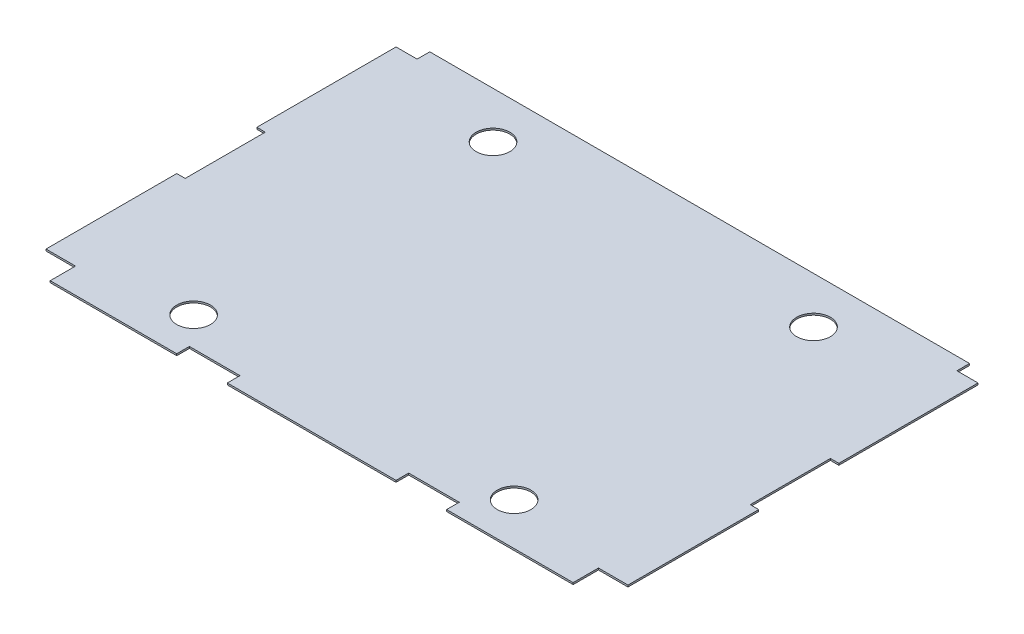
ISO-10303-21;
HEADER;
FILE_DESCRIPTION(('STEP AP214'),'2;1');
FILE_NAME('part.step','',(''),(''),'','','');
FILE_SCHEMA(('AUTOMOTIVE_DESIGN { 1 0 10303 214 1 1 1 1 }'));
ENDSEC;
DATA;
#1=APPLICATION_CONTEXT('core data for automotive mechanical design processes');
#2=APPLICATION_PROTOCOL_DEFINITION('international standard','automotive_design',2000,#1);
#3=PRODUCT_CONTEXT('',#1,'mechanical');
#4=PRODUCT('Part','Part','',(#3));
#5=PRODUCT_RELATED_PRODUCT_CATEGORY('part','',(#4));
#6=PRODUCT_DEFINITION_FORMATION('','',#4);
#7=PRODUCT_DEFINITION_CONTEXT('part definition',#1,'design');
#8=PRODUCT_DEFINITION('design','',#6,#7);
#9=PRODUCT_DEFINITION_SHAPE('','',#8);
#10=(LENGTH_UNIT() NAMED_UNIT(*) SI_UNIT(.MILLI.,.METRE.));
#11=(NAMED_UNIT(*) PLANE_ANGLE_UNIT() SI_UNIT($,.RADIAN.));
#12=(NAMED_UNIT(*) SI_UNIT($,.STERADIAN.) SOLID_ANGLE_UNIT());
#13=UNCERTAINTY_MEASURE_WITH_UNIT(LENGTH_MEASURE(1.E-05),#10,'distance_accuracy_value','');
#14=(GEOMETRIC_REPRESENTATION_CONTEXT(3) GLOBAL_UNCERTAINTY_ASSIGNED_CONTEXT((#13)) GLOBAL_UNIT_ASSIGNED_CONTEXT((#10,
#11,#12)) REPRESENTATION_CONTEXT('',''));
#15=CARTESIAN_POINT('',(0.,0.,0.));
#16=DIRECTION('',(0.,0.,1.));
#17=DIRECTION('',(1.,0.,0.));
#18=AXIS2_PLACEMENT_3D('',#15,#16,#17);
#19=CARTESIAN_POINT('',(0.,2.65684,0.));
#20=DIRECTION('',(0.,-1.,0.));
#21=DIRECTION('',(0.,0.,-1.));
#22=AXIS2_PLACEMENT_3D('',#19,#20,#21);
#23=PLANE('',#22);
#24=CARTESIAN_POINT('',(-241.3,2.65684,-222.25));
#25=DIRECTION('',(0.,1.,0.));
#26=DIRECTION('',(0.,0.,-1.));
#27=AXIS2_PLACEMENT_3D('',#24,#25,#26);
#28=CIRCLE('',#27,25.4);
#29=CARTESIAN_POINT('',(-241.3,2.65684,-247.65));
#30=VERTEX_POINT('',#29);
#31=EDGE_CURVE('E499',#30,#30,#28,.T.);
#32=ORIENTED_EDGE('',*,*,#31,.F.);
#33=EDGE_LOOP('',(#32));
#34=FACE_BOUND('',#33,.T.);
#35=CARTESIAN_POINT('',(241.3,2.65684,-222.25));
#36=DIRECTION('',(0.,1.,0.));
#37=DIRECTION('',(0.,0.,1.));
#38=AXIS2_PLACEMENT_3D('',#35,#36,#37);
#39=CIRCLE('',#38,25.4);
#40=CARTESIAN_POINT('',(241.3,2.65684,-196.85));
#41=VERTEX_POINT('',#40);
#42=EDGE_CURVE('E253',#41,#41,#39,.T.);
#43=ORIENTED_EDGE('',*,*,#42,.F.);
#44=EDGE_LOOP('',(#43));
#45=FACE_BOUND('',#44,.T.);
#46=DIRECTION('',(0.,0.,1.));
#47=VECTOR('',#46,1.);
#48=CARTESIAN_POINT('',(-438.15,2.65684,-63.5));
#49=LINE('',#48,#47);
#50=CARTESIAN_POINT('',(-438.15,2.65684,-273.05));
#51=VERTEX_POINT('',#50);
#52=CARTESIAN_POINT('',(-438.15,2.65684,-63.5));
#53=VERTEX_POINT('',#52);
#54=EDGE_CURVE('E304',#51,#53,#49,.T.);
#55=ORIENTED_EDGE('',*,*,#54,.T.);
#56=DIRECTION('',(1.,0.,0.));
#57=VECTOR('',#56,1.);
#58=CARTESIAN_POINT('',(-425.45,2.65684,-63.5));
#59=LINE('',#58,#57);
#60=CARTESIAN_POINT('',(-425.45,2.65684,-63.5));
#61=VERTEX_POINT('',#60);
#62=EDGE_CURVE('E152',#53,#61,#59,.T.);
#63=ORIENTED_EDGE('',*,*,#62,.T.);
#64=DIRECTION('',(0.,0.,1.));
#65=VECTOR('',#64,1.);
#66=CARTESIAN_POINT('',(-425.45,2.65684,57.15));
#67=LINE('',#66,#65);
#68=CARTESIAN_POINT('',(-425.45,2.65684,57.15));
#69=VERTEX_POINT('',#68);
#70=EDGE_CURVE('E379',#61,#69,#67,.T.);
#71=ORIENTED_EDGE('',*,*,#70,.T.);
#72=DIRECTION('',(-1.,0.,0.));
#73=VECTOR('',#72,1.);
#74=CARTESIAN_POINT('',(-438.15,2.65684,57.15));
#75=LINE('',#74,#73);
#76=CARTESIAN_POINT('',(-438.15,2.65684,57.15));
#77=VERTEX_POINT('',#76);
#78=EDGE_CURVE('E398',#69,#77,#75,.T.);
#79=ORIENTED_EDGE('',*,*,#78,.T.);
#80=DIRECTION('',(0.,0.,1.));
#81=VECTOR('',#80,1.);
#82=CARTESIAN_POINT('',(-438.15,2.65684,253.999999999999));
#83=LINE('',#82,#81);
#84=CARTESIAN_POINT('',(-438.15,2.65684,253.999999999999));
#85=VERTEX_POINT('',#84);
#86=EDGE_CURVE('E395',#77,#85,#83,.T.);
#87=ORIENTED_EDGE('',*,*,#86,.T.);
#88=DIRECTION('',(1.,0.,0.));
#89=VECTOR('',#88,1.);
#90=CARTESIAN_POINT('',(-393.7,2.65684,254.));
#91=LINE('',#90,#89);
#92=CARTESIAN_POINT('',(-393.7,2.65684,254.));
#93=VERTEX_POINT('',#92);
#94=EDGE_CURVE('E397',#85,#93,#91,.T.);
#95=ORIENTED_EDGE('',*,*,#94,.T.);
#96=DIRECTION('',(0.,0.,1.));
#97=VECTOR('',#96,1.);
#98=CARTESIAN_POINT('',(-393.7,2.65684,292.1));
#99=LINE('',#98,#97);
#100=CARTESIAN_POINT('',(-393.7,2.65684,292.1));
#101=VERTEX_POINT('',#100);
#102=EDGE_CURVE('E400',#93,#101,#99,.T.);
#103=ORIENTED_EDGE('',*,*,#102,.T.);
#104=DIRECTION('',(1.,0.,0.));
#105=VECTOR('',#104,1.);
#106=CARTESIAN_POINT('',(-203.2,2.65684,292.1));
#107=LINE('',#106,#105);
#108=CARTESIAN_POINT('',(-203.2,2.65684,292.1));
#109=VERTEX_POINT('',#108);
#110=EDGE_CURVE('E406',#101,#109,#107,.T.);
#111=ORIENTED_EDGE('',*,*,#110,.T.);
#112=DIRECTION('',(0.,0.,-1.));
#113=VECTOR('',#112,1.);
#114=CARTESIAN_POINT('',(-203.2,2.65684,273.05));
#115=LINE('',#114,#113);
#116=CARTESIAN_POINT('',(-203.2,2.65684,273.05));
#117=VERTEX_POINT('',#116);
#118=EDGE_CURVE('E408',#109,#117,#115,.T.);
#119=ORIENTED_EDGE('',*,*,#118,.T.);
#120=DIRECTION('',(1.,0.,0.));
#121=VECTOR('',#120,1.);
#122=CARTESIAN_POINT('',(-127.,2.65684,273.05));
#123=LINE('',#122,#121);
#124=CARTESIAN_POINT('',(-127.,2.65684,273.05));
#125=VERTEX_POINT('',#124);
#126=EDGE_CURVE('E410',#117,#125,#123,.T.);
#127=ORIENTED_EDGE('',*,*,#126,.T.);
#128=DIRECTION('',(0.,0.,1.));
#129=VECTOR('',#128,1.);
#130=CARTESIAN_POINT('',(-127.,2.65684,292.1));
#131=LINE('',#130,#129);
#132=CARTESIAN_POINT('',(-127.,2.65684,292.1));
#133=VERTEX_POINT('',#132);
#134=EDGE_CURVE('E412',#125,#133,#131,.T.);
#135=ORIENTED_EDGE('',*,*,#134,.T.);
#136=DIRECTION('',(1.,0.,0.));
#137=VECTOR('',#136,1.);
#138=CARTESIAN_POINT('',(127.,2.65684,292.1));
#139=LINE('',#138,#137);
#140=CARTESIAN_POINT('',(127.,2.65684,292.1));
#141=VERTEX_POINT('',#140);
#142=EDGE_CURVE('E414',#133,#141,#139,.T.);
#143=ORIENTED_EDGE('',*,*,#142,.T.);
#144=DIRECTION('',(0.,0.,-1.));
#145=VECTOR('',#144,1.);
#146=CARTESIAN_POINT('',(127.,2.65684,273.05));
#147=LINE('',#146,#145);
#148=CARTESIAN_POINT('',(127.,2.65684,273.05));
#149=VERTEX_POINT('',#148);
#150=EDGE_CURVE('E416',#141,#149,#147,.T.);
#151=ORIENTED_EDGE('',*,*,#150,.T.);
#152=DIRECTION('',(1.,0.,0.));
#153=VECTOR('',#152,1.);
#154=CARTESIAN_POINT('',(203.2,2.65684,273.05));
#155=LINE('',#154,#153);
#156=CARTESIAN_POINT('',(203.2,2.65684,273.05));
#157=VERTEX_POINT('',#156);
#158=EDGE_CURVE('E418',#149,#157,#155,.T.);
#159=ORIENTED_EDGE('',*,*,#158,.T.);
#160=DIRECTION('',(0.,0.,1.));
#161=VECTOR('',#160,1.);
#162=CARTESIAN_POINT('',(203.2,2.65684,292.1));
#163=LINE('',#162,#161);
#164=CARTESIAN_POINT('',(203.2,2.65684,292.1));
#165=VERTEX_POINT('',#164);
#166=EDGE_CURVE('E420',#157,#165,#163,.T.);
#167=ORIENTED_EDGE('',*,*,#166,.T.);
#168=DIRECTION('',(1.,0.,0.));
#169=VECTOR('',#168,1.);
#170=CARTESIAN_POINT('',(393.7,2.65684,292.1));
#171=LINE('',#170,#169);
#172=CARTESIAN_POINT('',(393.7,2.65684,292.1));
#173=VERTEX_POINT('',#172);
#174=EDGE_CURVE('E422',#165,#173,#171,.T.);
#175=ORIENTED_EDGE('',*,*,#174,.T.);
#176=DIRECTION('',(0.,0.,-1.));
#177=VECTOR('',#176,1.);
#178=CARTESIAN_POINT('',(393.7,2.65684,254.));
#179=LINE('',#178,#177);
#180=CARTESIAN_POINT('',(393.7,2.65684,254.));
#181=VERTEX_POINT('',#180);
#182=EDGE_CURVE('E424',#173,#181,#179,.T.);
#183=ORIENTED_EDGE('',*,*,#182,.T.);
#184=DIRECTION('',(1.,0.,0.));
#185=VECTOR('',#184,1.);
#186=CARTESIAN_POINT('',(438.15,2.65684,254.));
#187=LINE('',#186,#185);
#188=CARTESIAN_POINT('',(438.15,2.65684,254.));
#189=VERTEX_POINT('',#188);
#190=EDGE_CURVE('E426',#181,#189,#187,.T.);
#191=ORIENTED_EDGE('',*,*,#190,.T.);
#192=DIRECTION('',(0.,0.,-1.));
#193=VECTOR('',#192,1.);
#194=CARTESIAN_POINT('',(438.15,2.65684,57.1499999999999));
#195=LINE('',#194,#193);
#196=CARTESIAN_POINT('',(438.15,2.65684,57.1499999999999));
#197=VERTEX_POINT('',#196);
#198=EDGE_CURVE('E428',#189,#197,#195,.T.);
#199=ORIENTED_EDGE('',*,*,#198,.T.);
#200=DIRECTION('',(-1.,0.,0.));
#201=VECTOR('',#200,1.);
#202=CARTESIAN_POINT('',(425.45,2.65684,57.15));
#203=LINE('',#202,#201);
#204=CARTESIAN_POINT('',(425.45,2.65684,57.15));
#205=VERTEX_POINT('',#204);
#206=EDGE_CURVE('E430',#197,#205,#203,.T.);
#207=ORIENTED_EDGE('',*,*,#206,.T.);
#208=DIRECTION('',(0.,0.,-1.));
#209=VECTOR('',#208,1.);
#210=CARTESIAN_POINT('',(425.45,2.65684,-63.5));
#211=LINE('',#210,#209);
#212=CARTESIAN_POINT('',(425.45,2.65684,-63.5));
#213=VERTEX_POINT('',#212);
#214=EDGE_CURVE('E432',#205,#213,#211,.T.);
#215=ORIENTED_EDGE('',*,*,#214,.T.);
#216=DIRECTION('',(1.,0.,0.));
#217=VECTOR('',#216,1.);
#218=CARTESIAN_POINT('',(438.15,2.65684,-63.5000000000001));
#219=LINE('',#218,#217);
#220=CARTESIAN_POINT('',(438.15,2.65684,-63.5000000000001));
#221=VERTEX_POINT('',#220);
#222=EDGE_CURVE('E434',#213,#221,#219,.T.);
#223=ORIENTED_EDGE('',*,*,#222,.T.);
#224=DIRECTION('',(0.,0.,-1.));
#225=VECTOR('',#224,1.);
#226=CARTESIAN_POINT('',(438.15,2.65684,-273.05));
#227=LINE('',#226,#225);
#228=CARTESIAN_POINT('',(438.15,2.65684,-273.05));
#229=VERTEX_POINT('',#228);
#230=EDGE_CURVE('E436',#221,#229,#227,.T.);
#231=ORIENTED_EDGE('',*,*,#230,.T.);
#232=DIRECTION('',(-1.,0.,0.));
#233=VECTOR('',#232,1.);
#234=CARTESIAN_POINT('',(406.4,2.65684,-273.05));
#235=LINE('',#234,#233);
#236=CARTESIAN_POINT('',(406.4,2.65684,-273.05));
#237=VERTEX_POINT('',#236);
#238=EDGE_CURVE('E438',#229,#237,#235,.T.);
#239=ORIENTED_EDGE('',*,*,#238,.T.);
#240=DIRECTION('',(0.,0.,-1.));
#241=VECTOR('',#240,1.);
#242=CARTESIAN_POINT('',(406.4,2.65684,-292.1));
#243=LINE('',#242,#241);
#244=CARTESIAN_POINT('',(406.4,2.65684,-292.1));
#245=VERTEX_POINT('',#244);
#246=EDGE_CURVE('E231',#237,#245,#243,.T.);
#247=ORIENTED_EDGE('',*,*,#246,.T.);
#248=DIRECTION('',(-1.,0.,0.));
#249=VECTOR('',#248,1.);
#250=CARTESIAN_POINT('',(-406.4,2.65684,-292.1));
#251=LINE('',#250,#249);
#252=CARTESIAN_POINT('',(-406.4,2.65684,-292.1));
#253=VERTEX_POINT('',#252);
#254=EDGE_CURVE('E225',#245,#253,#251,.T.);
#255=ORIENTED_EDGE('',*,*,#254,.T.);
#256=DIRECTION('',(0.,0.,1.));
#257=VECTOR('',#256,1.);
#258=CARTESIAN_POINT('',(-406.4,2.65684,-273.05));
#259=LINE('',#258,#257);
#260=CARTESIAN_POINT('',(-406.4,2.65684,-273.05));
#261=VERTEX_POINT('',#260);
#262=EDGE_CURVE('E229',#253,#261,#259,.T.);
#263=ORIENTED_EDGE('',*,*,#262,.T.);
#264=DIRECTION('',(-1.,0.,0.));
#265=VECTOR('',#264,1.);
#266=CARTESIAN_POINT('',(-438.15,2.65684,-273.05));
#267=LINE('',#266,#265);
#268=EDGE_CURVE('E49',#261,#51,#267,.T.);
#269=ORIENTED_EDGE('',*,*,#268,.T.);
#270=EDGE_LOOP('',(#55,#63,#71,#79,#87,#95,#103,#111,#119,#127,#135,#143,#151,#159,#167,#175,
#183,#191,#199,#207,#215,#223,#231,#239,#247,#255,#263,#269));
#271=FACE_BOUND('',#270,.T.);
#272=CARTESIAN_POINT('',(241.3,2.65684,228.6));
#273=DIRECTION('',(0.,1.,0.));
#274=DIRECTION('',(0.,0.,1.));
#275=AXIS2_PLACEMENT_3D('',#272,#273,#274);
#276=CIRCLE('',#275,25.4);
#277=CARTESIAN_POINT('',(241.3,2.65684,254.));
#278=VERTEX_POINT('',#277);
#279=EDGE_CURVE('E505',#278,#278,#276,.T.);
#280=ORIENTED_EDGE('',*,*,#279,.F.);
#281=EDGE_LOOP('',(#280));
#282=FACE_BOUND('',#281,.T.);
#283=CARTESIAN_POINT('',(-241.3,2.65684,228.6));
#284=DIRECTION('',(0.,1.,0.));
#285=DIRECTION('',(0.,0.,-1.));
#286=AXIS2_PLACEMENT_3D('',#283,#284,#285);
#287=CIRCLE('',#286,25.4);
#288=CARTESIAN_POINT('',(-241.3,2.65684,203.2));
#289=VERTEX_POINT('',#288);
#290=EDGE_CURVE('E490',#289,#289,#287,.T.);
#291=ORIENTED_EDGE('',*,*,#290,.F.);
#292=EDGE_LOOP('',(#291));
#293=FACE_BOUND('',#292,.T.);
#294=ADVANCED_FACE('F32',(#34,#45,#271,#282,#293),#23,.F.);
#295=CARTESIAN_POINT('',(0.,0.,0.));
#296=DIRECTION('',(0.,-1.,0.));
#297=DIRECTION('',(0.,0.,-1.));
#298=AXIS2_PLACEMENT_3D('',#295,#296,#297);
#299=PLANE('',#298);
#300=CARTESIAN_POINT('',(-241.3,0.,-222.25));
#301=DIRECTION('',(0.,1.,0.));
#302=DIRECTION('',(0.,0.,-1.));
#303=AXIS2_PLACEMENT_3D('',#300,#301,#302);
#304=CIRCLE('',#303,25.4);
#305=CARTESIAN_POINT('',(-241.3,0.,-247.65));
#306=VERTEX_POINT('',#305);
#307=EDGE_CURVE('E496',#306,#306,#304,.T.);
#308=ORIENTED_EDGE('',*,*,#307,.T.);
#309=EDGE_LOOP('',(#308));
#310=FACE_BOUND('',#309,.T.);
#311=CARTESIAN_POINT('',(241.3,0.,-222.25));
#312=DIRECTION('',(0.,1.,0.));
#313=DIRECTION('',(0.,0.,1.));
#314=AXIS2_PLACEMENT_3D('',#311,#312,#313);
#315=CIRCLE('',#314,25.4);
#316=CARTESIAN_POINT('',(241.3,0.,-196.85));
#317=VERTEX_POINT('',#316);
#318=EDGE_CURVE('E508',#317,#317,#315,.T.);
#319=ORIENTED_EDGE('',*,*,#318,.T.);
#320=EDGE_LOOP('',(#319));
#321=FACE_BOUND('',#320,.T.);
#322=DIRECTION('',(0.,0.,1.));
#323=VECTOR('',#322,1.);
#324=CARTESIAN_POINT('',(-438.15,0.,-63.5));
#325=LINE('',#324,#323);
#326=CARTESIAN_POINT('',(-438.15,0.,-273.05));
#327=VERTEX_POINT('',#326);
#328=CARTESIAN_POINT('',(-438.15,0.,-63.5));
#329=VERTEX_POINT('',#328);
#330=EDGE_CURVE('E249',#327,#329,#325,.T.);
#331=ORIENTED_EDGE('',*,*,#330,.F.);
#332=DIRECTION('',(-1.,0.,0.));
#333=VECTOR('',#332,1.);
#334=CARTESIAN_POINT('',(-438.15,0.,-273.05));
#335=LINE('',#334,#333);
#336=CARTESIAN_POINT('',(-406.4,0.,-273.05));
#337=VERTEX_POINT('',#336);
#338=EDGE_CURVE('E144',#337,#327,#335,.T.);
#339=ORIENTED_EDGE('',*,*,#338,.F.);
#340=DIRECTION('',(0.,0.,1.));
#341=VECTOR('',#340,1.);
#342=CARTESIAN_POINT('',(-406.4,0.,-273.05));
#343=LINE('',#342,#341);
#344=CARTESIAN_POINT('',(-406.4,0.,-292.1));
#345=VERTEX_POINT('',#344);
#346=EDGE_CURVE('E138',#345,#337,#343,.T.);
#347=ORIENTED_EDGE('',*,*,#346,.F.);
#348=DIRECTION('',(-1.,0.,0.));
#349=VECTOR('',#348,1.);
#350=CARTESIAN_POINT('',(-406.4,0.,-292.1));
#351=LINE('',#350,#349);
#352=CARTESIAN_POINT('',(406.4,0.,-292.1));
#353=VERTEX_POINT('',#352);
#354=EDGE_CURVE('E239',#353,#345,#351,.T.);
#355=ORIENTED_EDGE('',*,*,#354,.F.);
#356=DIRECTION('',(0.,0.,-1.));
#357=VECTOR('',#356,1.);
#358=CARTESIAN_POINT('',(406.4,0.,-292.1));
#359=LINE('',#358,#357);
#360=CARTESIAN_POINT('',(406.4,0.,-273.05));
#361=VERTEX_POINT('',#360);
#362=EDGE_CURVE('E299',#361,#353,#359,.T.);
#363=ORIENTED_EDGE('',*,*,#362,.F.);
#364=DIRECTION('',(-1.,0.,0.));
#365=VECTOR('',#364,1.);
#366=CARTESIAN_POINT('',(406.4,0.,-273.05));
#367=LINE('',#366,#365);
#368=CARTESIAN_POINT('',(438.15,0.,-273.05));
#369=VERTEX_POINT('',#368);
#370=EDGE_CURVE('E297',#369,#361,#367,.T.);
#371=ORIENTED_EDGE('',*,*,#370,.F.);
#372=DIRECTION('',(0.,0.,-1.));
#373=VECTOR('',#372,1.);
#374=CARTESIAN_POINT('',(438.15,0.,-273.05));
#375=LINE('',#374,#373);
#376=CARTESIAN_POINT('',(438.15,0.,-63.5000000000001));
#377=VERTEX_POINT('',#376);
#378=EDGE_CURVE('E295',#377,#369,#375,.T.);
#379=ORIENTED_EDGE('',*,*,#378,.F.);
#380=DIRECTION('',(1.,0.,0.));
#381=VECTOR('',#380,1.);
#382=CARTESIAN_POINT('',(438.15,0.,-63.5000000000001));
#383=LINE('',#382,#381);
#384=CARTESIAN_POINT('',(425.45,0.,-63.5));
#385=VERTEX_POINT('',#384);
#386=EDGE_CURVE('E293',#385,#377,#383,.T.);
#387=ORIENTED_EDGE('',*,*,#386,.F.);
#388=DIRECTION('',(0.,0.,-1.));
#389=VECTOR('',#388,1.);
#390=CARTESIAN_POINT('',(425.45,0.,-63.5));
#391=LINE('',#390,#389);
#392=CARTESIAN_POINT('',(425.45,0.,57.15));
#393=VERTEX_POINT('',#392);
#394=EDGE_CURVE('E291',#393,#385,#391,.T.);
#395=ORIENTED_EDGE('',*,*,#394,.F.);
#396=DIRECTION('',(-1.,0.,0.));
#397=VECTOR('',#396,1.);
#398=CARTESIAN_POINT('',(425.45,0.,57.15));
#399=LINE('',#398,#397);
#400=CARTESIAN_POINT('',(438.15,0.,57.1499999999999));
#401=VERTEX_POINT('',#400);
#402=EDGE_CURVE('E289',#401,#393,#399,.T.);
#403=ORIENTED_EDGE('',*,*,#402,.F.);
#404=DIRECTION('',(0.,0.,-1.));
#405=VECTOR('',#404,1.);
#406=CARTESIAN_POINT('',(438.15,0.,57.1499999999999));
#407=LINE('',#406,#405);
#408=CARTESIAN_POINT('',(438.15,0.,254.));
#409=VERTEX_POINT('',#408);
#410=EDGE_CURVE('E287',#409,#401,#407,.T.);
#411=ORIENTED_EDGE('',*,*,#410,.F.);
#412=DIRECTION('',(1.,0.,0.));
#413=VECTOR('',#412,1.);
#414=CARTESIAN_POINT('',(438.15,0.,254.));
#415=LINE('',#414,#413);
#416=CARTESIAN_POINT('',(393.7,0.,254.));
#417=VERTEX_POINT('',#416);
#418=EDGE_CURVE('E285',#417,#409,#415,.T.);
#419=ORIENTED_EDGE('',*,*,#418,.F.);
#420=DIRECTION('',(0.,0.,-1.));
#421=VECTOR('',#420,1.);
#422=CARTESIAN_POINT('',(393.7,0.,254.));
#423=LINE('',#422,#421);
#424=CARTESIAN_POINT('',(393.7,0.,292.1));
#425=VERTEX_POINT('',#424);
#426=EDGE_CURVE('E283',#425,#417,#423,.T.);
#427=ORIENTED_EDGE('',*,*,#426,.F.);
#428=DIRECTION('',(1.,0.,0.));
#429=VECTOR('',#428,1.);
#430=CARTESIAN_POINT('',(393.7,0.,292.1));
#431=LINE('',#430,#429);
#432=CARTESIAN_POINT('',(203.2,0.,292.1));
#433=VERTEX_POINT('',#432);
#434=EDGE_CURVE('E281',#433,#425,#431,.T.);
#435=ORIENTED_EDGE('',*,*,#434,.F.);
#436=DIRECTION('',(0.,0.,1.));
#437=VECTOR('',#436,1.);
#438=CARTESIAN_POINT('',(203.2,0.,292.1));
#439=LINE('',#438,#437);
#440=CARTESIAN_POINT('',(203.2,0.,273.05));
#441=VERTEX_POINT('',#440);
#442=EDGE_CURVE('E279',#441,#433,#439,.T.);
#443=ORIENTED_EDGE('',*,*,#442,.F.);
#444=DIRECTION('',(1.,0.,0.));
#445=VECTOR('',#444,1.);
#446=CARTESIAN_POINT('',(203.2,0.,273.05));
#447=LINE('',#446,#445);
#448=CARTESIAN_POINT('',(127.,0.,273.05));
#449=VERTEX_POINT('',#448);
#450=EDGE_CURVE('E277',#449,#441,#447,.T.);
#451=ORIENTED_EDGE('',*,*,#450,.F.);
#452=DIRECTION('',(0.,0.,-1.));
#453=VECTOR('',#452,1.);
#454=CARTESIAN_POINT('',(127.,0.,273.05));
#455=LINE('',#454,#453);
#456=CARTESIAN_POINT('',(127.,0.,292.1));
#457=VERTEX_POINT('',#456);
#458=EDGE_CURVE('E275',#457,#449,#455,.T.);
#459=ORIENTED_EDGE('',*,*,#458,.F.);
#460=DIRECTION('',(1.,0.,0.));
#461=VECTOR('',#460,1.);
#462=CARTESIAN_POINT('',(127.,0.,292.1));
#463=LINE('',#462,#461);
#464=CARTESIAN_POINT('',(-127.,0.,292.1));
#465=VERTEX_POINT('',#464);
#466=EDGE_CURVE('E273',#465,#457,#463,.T.);
#467=ORIENTED_EDGE('',*,*,#466,.F.);
#468=DIRECTION('',(0.,0.,1.));
#469=VECTOR('',#468,1.);
#470=CARTESIAN_POINT('',(-127.,0.,292.1));
#471=LINE('',#470,#469);
#472=CARTESIAN_POINT('',(-127.,0.,273.05));
#473=VERTEX_POINT('',#472);
#474=EDGE_CURVE('E271',#473,#465,#471,.T.);
#475=ORIENTED_EDGE('',*,*,#474,.F.);
#476=DIRECTION('',(1.,0.,0.));
#477=VECTOR('',#476,1.);
#478=CARTESIAN_POINT('',(-127.,0.,273.05));
#479=LINE('',#478,#477);
#480=CARTESIAN_POINT('',(-203.2,0.,273.05));
#481=VERTEX_POINT('',#480);
#482=EDGE_CURVE('E269',#481,#473,#479,.T.);
#483=ORIENTED_EDGE('',*,*,#482,.F.);
#484=DIRECTION('',(0.,0.,-1.));
#485=VECTOR('',#484,1.);
#486=CARTESIAN_POINT('',(-203.2,0.,273.05));
#487=LINE('',#486,#485);
#488=CARTESIAN_POINT('',(-203.2,0.,292.1));
#489=VERTEX_POINT('',#488);
#490=EDGE_CURVE('E267',#489,#481,#487,.T.);
#491=ORIENTED_EDGE('',*,*,#490,.F.);
#492=DIRECTION('',(1.,0.,0.));
#493=VECTOR('',#492,1.);
#494=CARTESIAN_POINT('',(-203.2,0.,292.1));
#495=LINE('',#494,#493);
#496=CARTESIAN_POINT('',(-393.7,0.,292.1));
#497=VERTEX_POINT('',#496);
#498=EDGE_CURVE('E265',#497,#489,#495,.T.);
#499=ORIENTED_EDGE('',*,*,#498,.F.);
#500=DIRECTION('',(0.,0.,1.));
#501=VECTOR('',#500,1.);
#502=CARTESIAN_POINT('',(-393.7,0.,292.1));
#503=LINE('',#502,#501);
#504=CARTESIAN_POINT('',(-393.7,0.,254.));
#505=VERTEX_POINT('',#504);
#506=EDGE_CURVE('E263',#505,#497,#503,.T.);
#507=ORIENTED_EDGE('',*,*,#506,.F.);
#508=DIRECTION('',(1.,0.,0.));
#509=VECTOR('',#508,1.);
#510=CARTESIAN_POINT('',(-393.7,0.,254.));
#511=LINE('',#510,#509);
#512=CARTESIAN_POINT('',(-438.15,0.,253.999999999999));
#513=VERTEX_POINT('',#512);
#514=EDGE_CURVE('E261',#513,#505,#511,.T.);
#515=ORIENTED_EDGE('',*,*,#514,.F.);
#516=DIRECTION('',(0.,0.,1.));
#517=VECTOR('',#516,1.);
#518=CARTESIAN_POINT('',(-438.15,0.,253.999999999999));
#519=LINE('',#518,#517);
#520=CARTESIAN_POINT('',(-438.15,0.,57.15));
#521=VERTEX_POINT('',#520);
#522=EDGE_CURVE('E259',#521,#513,#519,.T.);
#523=ORIENTED_EDGE('',*,*,#522,.F.);
#524=DIRECTION('',(-1.,0.,0.));
#525=VECTOR('',#524,1.);
#526=CARTESIAN_POINT('',(-438.15,0.,57.15));
#527=LINE('',#526,#525);
#528=CARTESIAN_POINT('',(-425.45,0.,57.15));
#529=VERTEX_POINT('',#528);
#530=EDGE_CURVE('E257',#529,#521,#527,.T.);
#531=ORIENTED_EDGE('',*,*,#530,.F.);
#532=DIRECTION('',(0.,0.,1.));
#533=VECTOR('',#532,1.);
#534=CARTESIAN_POINT('',(-425.45,0.,57.15));
#535=LINE('',#534,#533);
#536=CARTESIAN_POINT('',(-425.45,0.,-63.5));
#537=VERTEX_POINT('',#536);
#538=EDGE_CURVE('E255',#537,#529,#535,.T.);
#539=ORIENTED_EDGE('',*,*,#538,.F.);
#540=DIRECTION('',(1.,0.,0.));
#541=VECTOR('',#540,1.);
#542=CARTESIAN_POINT('',(-425.45,0.,-63.5));
#543=LINE('',#542,#541);
#544=EDGE_CURVE('E252',#329,#537,#543,.T.);
#545=ORIENTED_EDGE('',*,*,#544,.F.);
#546=EDGE_LOOP('',(#331,#339,#347,#355,#363,#371,#379,#387,#395,#403,#411,#419,#427,#435,#443,
#451,#459,#467,#475,#483,#491,#499,#507,#515,#523,#531,#539,#545));
#547=FACE_BOUND('',#546,.T.);
#548=CARTESIAN_POINT('',(241.3,0.,228.6));
#549=DIRECTION('',(0.,1.,0.));
#550=DIRECTION('',(0.,0.,1.));
#551=AXIS2_PLACEMENT_3D('',#548,#549,#550);
#552=CIRCLE('',#551,25.4);
#553=CARTESIAN_POINT('',(241.3,0.,254.));
#554=VERTEX_POINT('',#553);
#555=EDGE_CURVE('E502',#554,#554,#552,.T.);
#556=ORIENTED_EDGE('',*,*,#555,.T.);
#557=EDGE_LOOP('',(#556));
#558=FACE_BOUND('',#557,.T.);
#559=CARTESIAN_POINT('',(-241.3,0.,228.6));
#560=DIRECTION('',(0.,1.,0.));
#561=DIRECTION('',(0.,0.,-1.));
#562=AXIS2_PLACEMENT_3D('',#559,#560,#561);
#563=CIRCLE('',#562,25.4);
#564=CARTESIAN_POINT('',(-241.3,0.,203.2));
#565=VERTEX_POINT('',#564);
#566=EDGE_CURVE('E493',#565,#565,#563,.T.);
#567=ORIENTED_EDGE('',*,*,#566,.T.);
#568=EDGE_LOOP('',(#567));
#569=FACE_BOUND('',#568,.T.);
#570=ADVANCED_FACE('F383',(#310,#321,#547,#558,#569),#299,.T.);
#571=CARTESIAN_POINT('',(-438.15,2.65684,-63.5));
#572=DIRECTION('',(1.,0.,0.));
#573=DIRECTION('',(0.,0.,-1.));
#574=AXIS2_PLACEMENT_3D('',#571,#572,#573);
#575=PLANE('',#574);
#576=ORIENTED_EDGE('',*,*,#330,.T.);
#577=DIRECTION('',(0.,-1.,0.));
#578=VECTOR('',#577,1.);
#579=CARTESIAN_POINT('',(-438.15,2.65684,-63.5));
#580=LINE('',#579,#578);
#581=EDGE_CURVE('E11',#53,#329,#580,.T.);
#582=ORIENTED_EDGE('',*,*,#581,.F.);
#583=ORIENTED_EDGE('',*,*,#54,.F.);
#584=DIRECTION('',(0.,-1.,0.));
#585=VECTOR('',#584,1.);
#586=CARTESIAN_POINT('',(-438.15,2.65684,-273.05));
#587=LINE('',#586,#585);
#588=EDGE_CURVE('E245',#51,#327,#587,.T.);
#589=ORIENTED_EDGE('',*,*,#588,.T.);
#590=EDGE_LOOP('',(#576,#582,#583,#589));
#591=FACE_BOUND('',#590,.T.);
#592=ADVANCED_FACE('F34',(#591),#575,.F.);
#593=CARTESIAN_POINT('',(-425.45,2.65684,-63.5));
#594=DIRECTION('',(0.,0.,-1.));
#595=DIRECTION('',(-1.,0.,0.));
#596=AXIS2_PLACEMENT_3D('',#593,#594,#595);
#597=PLANE('',#596);
#598=ORIENTED_EDGE('',*,*,#544,.T.);
#599=DIRECTION('',(0.,-1.,0.));
#600=VECTOR('',#599,1.);
#601=CARTESIAN_POINT('',(-425.45,2.65684,-63.5));
#602=LINE('',#601,#600);
#603=EDGE_CURVE('E41',#61,#537,#602,.T.);
#604=ORIENTED_EDGE('',*,*,#603,.F.);
#605=ORIENTED_EDGE('',*,*,#62,.F.);
#606=ORIENTED_EDGE('',*,*,#581,.T.);
#607=EDGE_LOOP('',(#598,#604,#605,#606));
#608=FACE_BOUND('',#607,.T.);
#609=ADVANCED_FACE('F777',(#608),#597,.F.);
#610=CARTESIAN_POINT('',(-425.45,2.65684,57.15));
#611=DIRECTION('',(1.,0.,0.));
#612=DIRECTION('',(0.,0.,-1.));
#613=AXIS2_PLACEMENT_3D('',#610,#611,#612);
#614=PLANE('',#613);
#615=ORIENTED_EDGE('',*,*,#538,.T.);
#616=DIRECTION('',(0.,-1.,0.));
#617=VECTOR('',#616,1.);
#618=CARTESIAN_POINT('',(-425.45,2.65684,57.15));
#619=LINE('',#618,#617);
#620=EDGE_CURVE('E371',#69,#529,#619,.T.);
#621=ORIENTED_EDGE('',*,*,#620,.F.);
#622=ORIENTED_EDGE('',*,*,#70,.F.);
#623=ORIENTED_EDGE('',*,*,#603,.T.);
#624=EDGE_LOOP('',(#615,#621,#622,#623));
#625=FACE_BOUND('',#624,.T.);
#626=ADVANCED_FACE('F377',(#625),#614,.F.);
#627=CARTESIAN_POINT('',(-438.15,2.65684,57.15));
#628=DIRECTION('',(0.,0.,1.));
#629=DIRECTION('',(1.,0.,0.));
#630=AXIS2_PLACEMENT_3D('',#627,#628,#629);
#631=PLANE('',#630);
#632=ORIENTED_EDGE('',*,*,#530,.T.);
#633=DIRECTION('',(0.,-1.,0.));
#634=VECTOR('',#633,1.);
#635=CARTESIAN_POINT('',(-438.15,2.65684,57.15));
#636=LINE('',#635,#634);
#637=EDGE_CURVE('E368',#77,#521,#636,.T.);
#638=ORIENTED_EDGE('',*,*,#637,.F.);
#639=ORIENTED_EDGE('',*,*,#78,.F.);
#640=ORIENTED_EDGE('',*,*,#620,.T.);
#641=EDGE_LOOP('',(#632,#638,#639,#640));
#642=FACE_BOUND('',#641,.T.);
#643=ADVANCED_FACE('F389',(#642),#631,.F.);
#644=CARTESIAN_POINT('',(-438.15,2.65684,253.999999999999));
#645=DIRECTION('',(1.,0.,0.));
#646=DIRECTION('',(0.,0.,-1.));
#647=AXIS2_PLACEMENT_3D('',#644,#645,#646);
#648=PLANE('',#647);
#649=ORIENTED_EDGE('',*,*,#522,.T.);
#650=DIRECTION('',(0.,-1.,0.));
#651=VECTOR('',#650,1.);
#652=CARTESIAN_POINT('',(-438.15,2.65684,253.999999999999));
#653=LINE('',#652,#651);
#654=EDGE_CURVE('E365',#85,#513,#653,.T.);
#655=ORIENTED_EDGE('',*,*,#654,.F.);
#656=ORIENTED_EDGE('',*,*,#86,.F.);
#657=ORIENTED_EDGE('',*,*,#637,.T.);
#658=EDGE_LOOP('',(#649,#655,#656,#657));
#659=FACE_BOUND('',#658,.T.);
#660=ADVANCED_FACE('F393',(#659),#648,.F.);
#661=CARTESIAN_POINT('',(-393.7,2.65684,254.));
#662=DIRECTION('',(0.,0.,-1.));
#663=DIRECTION('',(-1.,0.,0.));
#664=AXIS2_PLACEMENT_3D('',#661,#662,#663);
#665=PLANE('',#664);
#666=ORIENTED_EDGE('',*,*,#514,.T.);
#667=DIRECTION('',(0.,-1.,0.));
#668=VECTOR('',#667,1.);
#669=CARTESIAN_POINT('',(-393.7,2.65684,254.));
#670=LINE('',#669,#668);
#671=EDGE_CURVE('E362',#93,#505,#670,.T.);
#672=ORIENTED_EDGE('',*,*,#671,.F.);
#673=ORIENTED_EDGE('',*,*,#94,.F.);
#674=ORIENTED_EDGE('',*,*,#654,.T.);
#675=EDGE_LOOP('',(#666,#672,#673,#674));
#676=FACE_BOUND('',#675,.T.);
#677=ADVANCED_FACE('F742',(#676),#665,.F.);
#678=CARTESIAN_POINT('',(-393.7,2.65684,292.1));
#679=DIRECTION('',(1.,0.,0.));
#680=DIRECTION('',(0.,0.,-1.));
#681=AXIS2_PLACEMENT_3D('',#678,#679,#680);
#682=PLANE('',#681);
#683=ORIENTED_EDGE('',*,*,#506,.T.);
#684=DIRECTION('',(0.,-1.,0.));
#685=VECTOR('',#684,1.);
#686=CARTESIAN_POINT('',(-393.7,2.65684,292.1));
#687=LINE('',#686,#685);
#688=EDGE_CURVE('E359',#101,#497,#687,.T.);
#689=ORIENTED_EDGE('',*,*,#688,.F.);
#690=ORIENTED_EDGE('',*,*,#102,.F.);
#691=ORIENTED_EDGE('',*,*,#671,.T.);
#692=EDGE_LOOP('',(#683,#689,#690,#691));
#693=FACE_BOUND('',#692,.T.);
#694=ADVANCED_FACE('F732',(#693),#682,.F.);
#695=CARTESIAN_POINT('',(-203.2,2.65684,292.1));
#696=DIRECTION('',(0.,0.,-1.));
#697=DIRECTION('',(-1.,0.,0.));
#698=AXIS2_PLACEMENT_3D('',#695,#696,#697);
#699=PLANE('',#698);
#700=ORIENTED_EDGE('',*,*,#498,.T.);
#701=DIRECTION('',(0.,-1.,0.));
#702=VECTOR('',#701,1.);
#703=CARTESIAN_POINT('',(-203.2,2.65684,292.1));
#704=LINE('',#703,#702);
#705=EDGE_CURVE('E356',#109,#489,#704,.T.);
#706=ORIENTED_EDGE('',*,*,#705,.F.);
#707=ORIENTED_EDGE('',*,*,#110,.F.);
#708=ORIENTED_EDGE('',*,*,#688,.T.);
#709=EDGE_LOOP('',(#700,#706,#707,#708));
#710=FACE_BOUND('',#709,.T.);
#711=ADVANCED_FACE('F722',(#710),#699,.F.);
#712=CARTESIAN_POINT('',(-203.2,2.65684,273.05));
#713=DIRECTION('',(-1.,0.,0.));
#714=DIRECTION('',(0.,0.,1.));
#715=AXIS2_PLACEMENT_3D('',#712,#713,#714);
#716=PLANE('',#715);
#717=ORIENTED_EDGE('',*,*,#490,.T.);
#718=DIRECTION('',(0.,-1.,0.));
#719=VECTOR('',#718,1.);
#720=CARTESIAN_POINT('',(-203.2,2.65684,273.05));
#721=LINE('',#720,#719);
#722=EDGE_CURVE('E353',#117,#481,#721,.T.);
#723=ORIENTED_EDGE('',*,*,#722,.F.);
#724=ORIENTED_EDGE('',*,*,#118,.F.);
#725=ORIENTED_EDGE('',*,*,#705,.T.);
#726=EDGE_LOOP('',(#717,#723,#724,#725));
#727=FACE_BOUND('',#726,.T.);
#728=ADVANCED_FACE('F712',(#727),#716,.F.);
#729=CARTESIAN_POINT('',(-127.,2.65684,273.05));
#730=DIRECTION('',(0.,0.,-1.));
#731=DIRECTION('',(-1.,0.,0.));
#732=AXIS2_PLACEMENT_3D('',#729,#730,#731);
#733=PLANE('',#732);
#734=ORIENTED_EDGE('',*,*,#482,.T.);
#735=DIRECTION('',(0.,-1.,0.));
#736=VECTOR('',#735,1.);
#737=CARTESIAN_POINT('',(-127.,2.65684,273.05));
#738=LINE('',#737,#736);
#739=EDGE_CURVE('E350',#125,#473,#738,.T.);
#740=ORIENTED_EDGE('',*,*,#739,.F.);
#741=ORIENTED_EDGE('',*,*,#126,.F.);
#742=ORIENTED_EDGE('',*,*,#722,.T.);
#743=EDGE_LOOP('',(#734,#740,#741,#742));
#744=FACE_BOUND('',#743,.T.);
#745=ADVANCED_FACE('F702',(#744),#733,.F.);
#746=CARTESIAN_POINT('',(-127.,2.65684,292.1));
#747=DIRECTION('',(1.,0.,0.));
#748=DIRECTION('',(0.,0.,-1.));
#749=AXIS2_PLACEMENT_3D('',#746,#747,#748);
#750=PLANE('',#749);
#751=ORIENTED_EDGE('',*,*,#474,.T.);
#752=DIRECTION('',(0.,-1.,0.));
#753=VECTOR('',#752,1.);
#754=CARTESIAN_POINT('',(-127.,2.65684,292.1));
#755=LINE('',#754,#753);
#756=EDGE_CURVE('E347',#133,#465,#755,.T.);
#757=ORIENTED_EDGE('',*,*,#756,.F.);
#758=ORIENTED_EDGE('',*,*,#134,.F.);
#759=ORIENTED_EDGE('',*,*,#739,.T.);
#760=EDGE_LOOP('',(#751,#757,#758,#759));
#761=FACE_BOUND('',#760,.T.);
#762=ADVANCED_FACE('F692',(#761),#750,.F.);
#763=CARTESIAN_POINT('',(127.,2.65684,292.1));
#764=DIRECTION('',(0.,0.,-1.));
#765=DIRECTION('',(-1.,0.,0.));
#766=AXIS2_PLACEMENT_3D('',#763,#764,#765);
#767=PLANE('',#766);
#768=ORIENTED_EDGE('',*,*,#466,.T.);
#769=DIRECTION('',(0.,-1.,0.));
#770=VECTOR('',#769,1.);
#771=CARTESIAN_POINT('',(127.,2.65684,292.1));
#772=LINE('',#771,#770);
#773=EDGE_CURVE('E344',#141,#457,#772,.T.);
#774=ORIENTED_EDGE('',*,*,#773,.F.);
#775=ORIENTED_EDGE('',*,*,#142,.F.);
#776=ORIENTED_EDGE('',*,*,#756,.T.);
#777=EDGE_LOOP('',(#768,#774,#775,#776));
#778=FACE_BOUND('',#777,.T.);
#779=ADVANCED_FACE('F682',(#778),#767,.F.);
#780=CARTESIAN_POINT('',(127.,2.65684,273.05));
#781=DIRECTION('',(-1.,0.,0.));
#782=DIRECTION('',(0.,0.,1.));
#783=AXIS2_PLACEMENT_3D('',#780,#781,#782);
#784=PLANE('',#783);
#785=ORIENTED_EDGE('',*,*,#458,.T.);
#786=DIRECTION('',(0.,-1.,0.));
#787=VECTOR('',#786,1.);
#788=CARTESIAN_POINT('',(127.,2.65684,273.05));
#789=LINE('',#788,#787);
#790=EDGE_CURVE('E341',#149,#449,#789,.T.);
#791=ORIENTED_EDGE('',*,*,#790,.F.);
#792=ORIENTED_EDGE('',*,*,#150,.F.);
#793=ORIENTED_EDGE('',*,*,#773,.T.);
#794=EDGE_LOOP('',(#785,#791,#792,#793));
#795=FACE_BOUND('',#794,.T.);
#796=ADVANCED_FACE('F672',(#795),#784,.F.);
#797=CARTESIAN_POINT('',(203.2,2.65684,273.05));
#798=DIRECTION('',(0.,0.,-1.));
#799=DIRECTION('',(-1.,0.,0.));
#800=AXIS2_PLACEMENT_3D('',#797,#798,#799);
#801=PLANE('',#800);
#802=ORIENTED_EDGE('',*,*,#450,.T.);
#803=DIRECTION('',(0.,-1.,0.));
#804=VECTOR('',#803,1.);
#805=CARTESIAN_POINT('',(203.2,2.65684,273.05));
#806=LINE('',#805,#804);
#807=EDGE_CURVE('E338',#157,#441,#806,.T.);
#808=ORIENTED_EDGE('',*,*,#807,.F.);
#809=ORIENTED_EDGE('',*,*,#158,.F.);
#810=ORIENTED_EDGE('',*,*,#790,.T.);
#811=EDGE_LOOP('',(#802,#808,#809,#810));
#812=FACE_BOUND('',#811,.T.);
#813=ADVANCED_FACE('F662',(#812),#801,.F.);
#814=CARTESIAN_POINT('',(203.2,2.65684,292.1));
#815=DIRECTION('',(1.,0.,0.));
#816=DIRECTION('',(0.,0.,-1.));
#817=AXIS2_PLACEMENT_3D('',#814,#815,#816);
#818=PLANE('',#817);
#819=ORIENTED_EDGE('',*,*,#442,.T.);
#820=DIRECTION('',(0.,-1.,0.));
#821=VECTOR('',#820,1.);
#822=CARTESIAN_POINT('',(203.2,2.65684,292.1));
#823=LINE('',#822,#821);
#824=EDGE_CURVE('E335',#165,#433,#823,.T.);
#825=ORIENTED_EDGE('',*,*,#824,.F.);
#826=ORIENTED_EDGE('',*,*,#166,.F.);
#827=ORIENTED_EDGE('',*,*,#807,.T.);
#828=EDGE_LOOP('',(#819,#825,#826,#827));
#829=FACE_BOUND('',#828,.T.);
#830=ADVANCED_FACE('F652',(#829),#818,.F.);
#831=CARTESIAN_POINT('',(393.7,2.65684,292.1));
#832=DIRECTION('',(0.,0.,-1.));
#833=DIRECTION('',(-1.,0.,0.));
#834=AXIS2_PLACEMENT_3D('',#831,#832,#833);
#835=PLANE('',#834);
#836=ORIENTED_EDGE('',*,*,#434,.T.);
#837=DIRECTION('',(0.,-1.,0.));
#838=VECTOR('',#837,1.);
#839=CARTESIAN_POINT('',(393.7,2.65684,292.1));
#840=LINE('',#839,#838);
#841=EDGE_CURVE('E332',#173,#425,#840,.T.);
#842=ORIENTED_EDGE('',*,*,#841,.F.);
#843=ORIENTED_EDGE('',*,*,#174,.F.);
#844=ORIENTED_EDGE('',*,*,#824,.T.);
#845=EDGE_LOOP('',(#836,#842,#843,#844));
#846=FACE_BOUND('',#845,.T.);
#847=ADVANCED_FACE('F642',(#846),#835,.F.);
#848=CARTESIAN_POINT('',(393.7,2.65684,254.));
#849=DIRECTION('',(-1.,0.,0.));
#850=DIRECTION('',(0.,0.,1.));
#851=AXIS2_PLACEMENT_3D('',#848,#849,#850);
#852=PLANE('',#851);
#853=ORIENTED_EDGE('',*,*,#426,.T.);
#854=DIRECTION('',(0.,-1.,0.));
#855=VECTOR('',#854,1.);
#856=CARTESIAN_POINT('',(393.7,2.65684,254.));
#857=LINE('',#856,#855);
#858=EDGE_CURVE('E329',#181,#417,#857,.T.);
#859=ORIENTED_EDGE('',*,*,#858,.F.);
#860=ORIENTED_EDGE('',*,*,#182,.F.);
#861=ORIENTED_EDGE('',*,*,#841,.T.);
#862=EDGE_LOOP('',(#853,#859,#860,#861));
#863=FACE_BOUND('',#862,.T.);
#864=ADVANCED_FACE('F632',(#863),#852,.F.);
#865=CARTESIAN_POINT('',(438.15,2.65684,254.));
#866=DIRECTION('',(0.,0.,-1.));
#867=DIRECTION('',(-1.,0.,0.));
#868=AXIS2_PLACEMENT_3D('',#865,#866,#867);
#869=PLANE('',#868);
#870=ORIENTED_EDGE('',*,*,#418,.T.);
#871=DIRECTION('',(0.,-1.,0.));
#872=VECTOR('',#871,1.);
#873=CARTESIAN_POINT('',(438.15,2.65684,254.));
#874=LINE('',#873,#872);
#875=EDGE_CURVE('E326',#189,#409,#874,.T.);
#876=ORIENTED_EDGE('',*,*,#875,.F.);
#877=ORIENTED_EDGE('',*,*,#190,.F.);
#878=ORIENTED_EDGE('',*,*,#858,.T.);
#879=EDGE_LOOP('',(#870,#876,#877,#878));
#880=FACE_BOUND('',#879,.T.);
#881=ADVANCED_FACE('F622',(#880),#869,.F.);
#882=CARTESIAN_POINT('',(438.15,2.65684,57.1499999999999));
#883=DIRECTION('',(-1.,0.,0.));
#884=DIRECTION('',(0.,0.,1.));
#885=AXIS2_PLACEMENT_3D('',#882,#883,#884);
#886=PLANE('',#885);
#887=ORIENTED_EDGE('',*,*,#410,.T.);
#888=DIRECTION('',(0.,-1.,0.));
#889=VECTOR('',#888,1.);
#890=CARTESIAN_POINT('',(438.15,2.65684,57.1499999999999));
#891=LINE('',#890,#889);
#892=EDGE_CURVE('E323',#197,#401,#891,.T.);
#893=ORIENTED_EDGE('',*,*,#892,.F.);
#894=ORIENTED_EDGE('',*,*,#198,.F.);
#895=ORIENTED_EDGE('',*,*,#875,.T.);
#896=EDGE_LOOP('',(#887,#893,#894,#895));
#897=FACE_BOUND('',#896,.T.);
#898=ADVANCED_FACE('F612',(#897),#886,.F.);
#899=CARTESIAN_POINT('',(425.45,2.65684,57.15));
#900=DIRECTION('',(0.,0.,1.));
#901=DIRECTION('',(1.,0.,0.));
#902=AXIS2_PLACEMENT_3D('',#899,#900,#901);
#903=PLANE('',#902);
#904=ORIENTED_EDGE('',*,*,#402,.T.);
#905=DIRECTION('',(0.,-1.,0.));
#906=VECTOR('',#905,1.);
#907=CARTESIAN_POINT('',(425.45,2.65684,57.15));
#908=LINE('',#907,#906);
#909=EDGE_CURVE('E320',#205,#393,#908,.T.);
#910=ORIENTED_EDGE('',*,*,#909,.F.);
#911=ORIENTED_EDGE('',*,*,#206,.F.);
#912=ORIENTED_EDGE('',*,*,#892,.T.);
#913=EDGE_LOOP('',(#904,#910,#911,#912));
#914=FACE_BOUND('',#913,.T.);
#915=ADVANCED_FACE('F602',(#914),#903,.F.);
#916=CARTESIAN_POINT('',(425.45,2.65684,-63.5));
#917=DIRECTION('',(-1.,0.,0.));
#918=DIRECTION('',(0.,0.,1.));
#919=AXIS2_PLACEMENT_3D('',#916,#917,#918);
#920=PLANE('',#919);
#921=ORIENTED_EDGE('',*,*,#394,.T.);
#922=DIRECTION('',(0.,-1.,0.));
#923=VECTOR('',#922,1.);
#924=CARTESIAN_POINT('',(425.45,2.65684,-63.5));
#925=LINE('',#924,#923);
#926=EDGE_CURVE('E317',#213,#385,#925,.T.);
#927=ORIENTED_EDGE('',*,*,#926,.F.);
#928=ORIENTED_EDGE('',*,*,#214,.F.);
#929=ORIENTED_EDGE('',*,*,#909,.T.);
#930=EDGE_LOOP('',(#921,#927,#928,#929));
#931=FACE_BOUND('',#930,.T.);
#932=ADVANCED_FACE('F592',(#931),#920,.F.);
#933=CARTESIAN_POINT('',(438.15,2.65684,-63.5000000000001));
#934=DIRECTION('',(0.,0.,-1.));
#935=DIRECTION('',(-1.,0.,0.));
#936=AXIS2_PLACEMENT_3D('',#933,#934,#935);
#937=PLANE('',#936);
#938=ORIENTED_EDGE('',*,*,#386,.T.);
#939=DIRECTION('',(0.,-1.,0.));
#940=VECTOR('',#939,1.);
#941=CARTESIAN_POINT('',(438.15,2.65684,-63.5000000000001));
#942=LINE('',#941,#940);
#943=EDGE_CURVE('E314',#221,#377,#942,.T.);
#944=ORIENTED_EDGE('',*,*,#943,.F.);
#945=ORIENTED_EDGE('',*,*,#222,.F.);
#946=ORIENTED_EDGE('',*,*,#926,.T.);
#947=EDGE_LOOP('',(#938,#944,#945,#946));
#948=FACE_BOUND('',#947,.T.);
#949=ADVANCED_FACE('F582',(#948),#937,.F.);
#950=CARTESIAN_POINT('',(438.15,2.65684,-273.05));
#951=DIRECTION('',(-1.,0.,0.));
#952=DIRECTION('',(0.,0.,1.));
#953=AXIS2_PLACEMENT_3D('',#950,#951,#952);
#954=PLANE('',#953);
#955=ORIENTED_EDGE('',*,*,#378,.T.);
#956=DIRECTION('',(0.,-1.,0.));
#957=VECTOR('',#956,1.);
#958=CARTESIAN_POINT('',(438.15,2.65684,-273.05));
#959=LINE('',#958,#957);
#960=EDGE_CURVE('E311',#229,#369,#959,.T.);
#961=ORIENTED_EDGE('',*,*,#960,.F.);
#962=ORIENTED_EDGE('',*,*,#230,.F.);
#963=ORIENTED_EDGE('',*,*,#943,.T.);
#964=EDGE_LOOP('',(#955,#961,#962,#963));
#965=FACE_BOUND('',#964,.T.);
#966=ADVANCED_FACE('F573',(#965),#954,.F.);
#967=CARTESIAN_POINT('',(406.4,2.65684,-273.05));
#968=DIRECTION('',(0.,0.,1.));
#969=DIRECTION('',(1.,0.,0.));
#970=AXIS2_PLACEMENT_3D('',#967,#968,#969);
#971=PLANE('',#970);
#972=ORIENTED_EDGE('',*,*,#370,.T.);
#973=DIRECTION('',(0.,-1.,0.));
#974=VECTOR('',#973,1.);
#975=CARTESIAN_POINT('',(406.4,2.65684,-273.05));
#976=LINE('',#975,#974);
#977=EDGE_CURVE('E308',#237,#361,#976,.T.);
#978=ORIENTED_EDGE('',*,*,#977,.F.);
#979=ORIENTED_EDGE('',*,*,#238,.F.);
#980=ORIENTED_EDGE('',*,*,#960,.T.);
#981=EDGE_LOOP('',(#972,#978,#979,#980));
#982=FACE_BOUND('',#981,.T.);
#983=ADVANCED_FACE('F444',(#982),#971,.F.);
#984=CARTESIAN_POINT('',(406.4,2.65684,-292.1));
#985=DIRECTION('',(-1.,0.,0.));
#986=DIRECTION('',(0.,0.,1.));
#987=AXIS2_PLACEMENT_3D('',#984,#985,#986);
#988=PLANE('',#987);
#989=ORIENTED_EDGE('',*,*,#362,.T.);
#990=DIRECTION('',(0.,-1.,0.));
#991=VECTOR('',#990,1.);
#992=CARTESIAN_POINT('',(406.4,2.65684,-292.1));
#993=LINE('',#992,#991);
#994=EDGE_CURVE('E240',#245,#353,#993,.T.);
#995=ORIENTED_EDGE('',*,*,#994,.F.);
#996=ORIENTED_EDGE('',*,*,#246,.F.);
#997=ORIENTED_EDGE('',*,*,#977,.T.);
#998=EDGE_LOOP('',(#989,#995,#996,#997));
#999=FACE_BOUND('',#998,.T.);
#1000=ADVANCED_FACE('F448',(#999),#988,.F.);
#1001=CARTESIAN_POINT('',(-406.4,2.65684,-292.1));
#1002=DIRECTION('',(0.,0.,1.));
#1003=DIRECTION('',(1.,0.,0.));
#1004=AXIS2_PLACEMENT_3D('',#1001,#1002,#1003);
#1005=PLANE('',#1004);
#1006=ORIENTED_EDGE('',*,*,#354,.T.);
#1007=DIRECTION('',(0.,-1.,0.));
#1008=VECTOR('',#1007,1.);
#1009=CARTESIAN_POINT('',(-406.4,2.65684,-292.1));
#1010=LINE('',#1009,#1008);
#1011=EDGE_CURVE('E236',#253,#345,#1010,.T.);
#1012=ORIENTED_EDGE('',*,*,#1011,.F.);
#1013=ORIENTED_EDGE('',*,*,#254,.F.);
#1014=ORIENTED_EDGE('',*,*,#994,.T.);
#1015=EDGE_LOOP('',(#1006,#1012,#1013,#1014));
#1016=FACE_BOUND('',#1015,.T.);
#1017=ADVANCED_FACE('F237',(#1016),#1005,.F.);
#1018=CARTESIAN_POINT('',(-406.4,2.65684,-273.05));
#1019=DIRECTION('',(1.,0.,0.));
#1020=DIRECTION('',(0.,0.,-1.));
#1021=AXIS2_PLACEMENT_3D('',#1018,#1019,#1020);
#1022=PLANE('',#1021);
#1023=ORIENTED_EDGE('',*,*,#346,.T.);
#1024=DIRECTION('',(0.,-1.,0.));
#1025=VECTOR('',#1024,1.);
#1026=CARTESIAN_POINT('',(-406.4,2.65684,-273.05));
#1027=LINE('',#1026,#1025);
#1028=EDGE_CURVE('E241',#261,#337,#1027,.T.);
#1029=ORIENTED_EDGE('',*,*,#1028,.F.);
#1030=ORIENTED_EDGE('',*,*,#262,.F.);
#1031=ORIENTED_EDGE('',*,*,#1011,.T.);
#1032=EDGE_LOOP('',(#1023,#1029,#1030,#1031));
#1033=FACE_BOUND('',#1032,.T.);
#1034=ADVANCED_FACE('F243',(#1033),#1022,.F.);
#1035=CARTESIAN_POINT('',(-438.15,2.65684,-273.05));
#1036=DIRECTION('',(0.,0.,1.));
#1037=DIRECTION('',(1.,0.,0.));
#1038=AXIS2_PLACEMENT_3D('',#1035,#1036,#1037);
#1039=PLANE('',#1038);
#1040=ORIENTED_EDGE('',*,*,#338,.T.);
#1041=ORIENTED_EDGE('',*,*,#588,.F.);
#1042=ORIENTED_EDGE('',*,*,#268,.F.);
#1043=ORIENTED_EDGE('',*,*,#1028,.T.);
#1044=EDGE_LOOP('',(#1040,#1041,#1042,#1043));
#1045=FACE_BOUND('',#1044,.T.);
#1046=ADVANCED_FACE('F452',(#1045),#1039,.F.);
#1047=CARTESIAN_POINT('',(241.3,2.65684,-222.25));
#1048=DIRECTION('',(0.,-1.,0.));
#1049=DIRECTION('',(0.,0.,-1.));
#1050=AXIS2_PLACEMENT_3D('',#1047,#1048,#1049);
#1051=CYLINDRICAL_SURFACE('',#1050,25.4);
#1052=ORIENTED_EDGE('',*,*,#42,.T.);
#1053=EDGE_LOOP('',(#1052));
#1054=FACE_BOUND('',#1053,.T.);
#1055=ORIENTED_EDGE('',*,*,#318,.F.);
#1056=EDGE_LOOP('',(#1055));
#1057=FACE_BOUND('',#1056,.T.);
#1058=ADVANCED_FACE('F454',(#1054,#1057),#1051,.F.);
#1059=CARTESIAN_POINT('',(241.3,2.65684,228.6));
#1060=DIRECTION('',(0.,-1.,0.));
#1061=DIRECTION('',(0.,0.,-1.));
#1062=AXIS2_PLACEMENT_3D('',#1059,#1060,#1061);
#1063=CYLINDRICAL_SURFACE('',#1062,25.4);
#1064=ORIENTED_EDGE('',*,*,#279,.T.);
#1065=EDGE_LOOP('',(#1064));
#1066=FACE_BOUND('',#1065,.T.);
#1067=ORIENTED_EDGE('',*,*,#555,.F.);
#1068=EDGE_LOOP('',(#1067));
#1069=FACE_BOUND('',#1068,.T.);
#1070=ADVANCED_FACE('F460',(#1066,#1069),#1063,.F.);
#1071=CARTESIAN_POINT('',(-241.3,2.65684,-222.25));
#1072=DIRECTION('',(0.,-1.,0.));
#1073=DIRECTION('',(0.,0.,-1.));
#1074=AXIS2_PLACEMENT_3D('',#1071,#1072,#1073);
#1075=CYLINDRICAL_SURFACE('',#1074,25.4);
#1076=ORIENTED_EDGE('',*,*,#31,.T.);
#1077=EDGE_LOOP('',(#1076));
#1078=FACE_BOUND('',#1077,.T.);
#1079=ORIENTED_EDGE('',*,*,#307,.F.);
#1080=EDGE_LOOP('',(#1079));
#1081=FACE_BOUND('',#1080,.T.);
#1082=ADVANCED_FACE('F477',(#1078,#1081),#1075,.F.);
#1083=CARTESIAN_POINT('',(-241.3,2.65684,228.6));
#1084=DIRECTION('',(0.,-1.,0.));
#1085=DIRECTION('',(0.,0.,-1.));
#1086=AXIS2_PLACEMENT_3D('',#1083,#1084,#1085);
#1087=CYLINDRICAL_SURFACE('',#1086,25.4);
#1088=ORIENTED_EDGE('',*,*,#290,.T.);
#1089=EDGE_LOOP('',(#1088));
#1090=FACE_BOUND('',#1089,.T.);
#1091=ORIENTED_EDGE('',*,*,#566,.F.);
#1092=EDGE_LOOP('',(#1091));
#1093=FACE_BOUND('',#1092,.T.);
#1094=ADVANCED_FACE('F481',(#1090,#1093),#1087,.F.);
#1095=CLOSED_SHELL('',(#294,#570,#592,#609,#626,#643,#660,#677,#694,#711,#728,#745,#762,#779,
#796,#813,#830,#847,#864,#881,#898,#915,#932,#949,#966,#983,#1000,#1017,#1034,#1046,#1058,#1070,
#1082,#1094));
#1096=MANIFOLD_SOLID_BREP('B2',#1095);
#1097=ADVANCED_BREP_SHAPE_REPRESENTATION('',(#18,#1096),#14);
#1098=SHAPE_DEFINITION_REPRESENTATION(#9,#1097);
ENDSEC;
END-ISO-10303-21;
